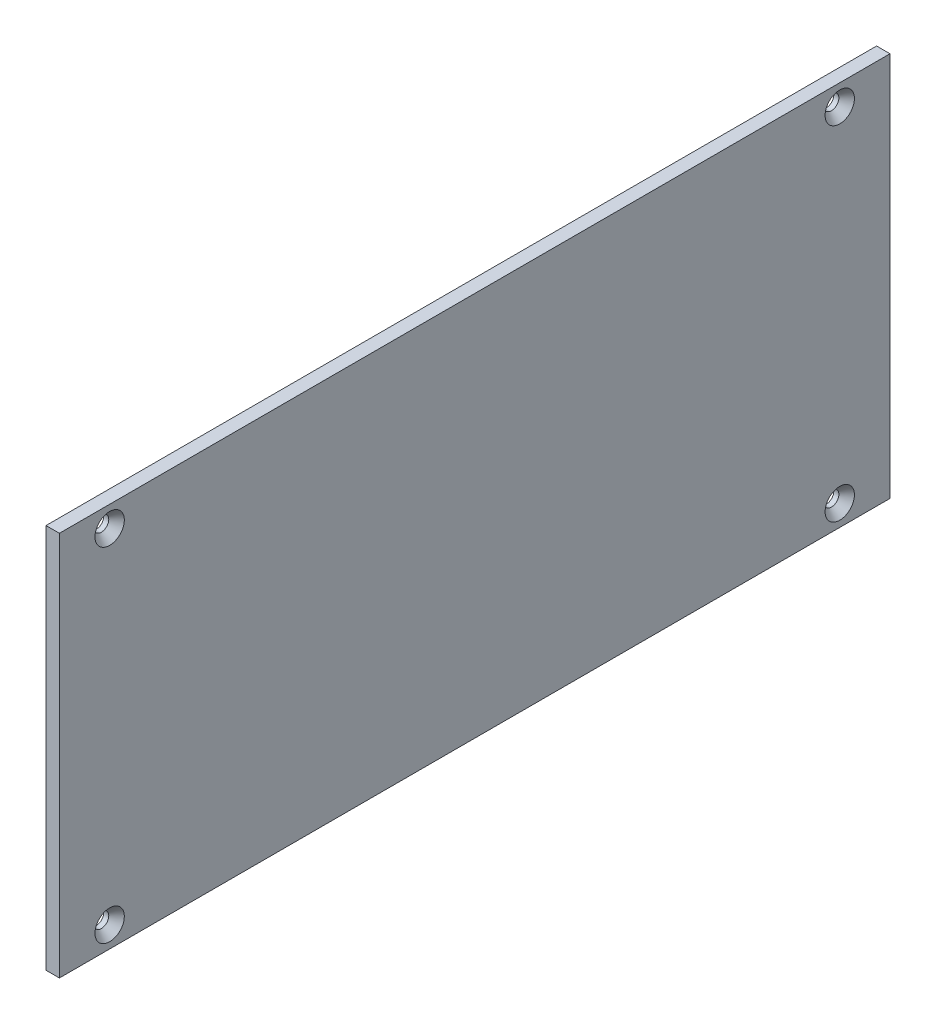
ISO-10303-21;
HEADER;
FILE_DESCRIPTION(('STEP AP214'),'2;1');
FILE_NAME('part.step','',(''),(''),'','','');
FILE_SCHEMA(('AUTOMOTIVE_DESIGN { 1 0 10303 214 1 1 1 1 }'));
ENDSEC;
DATA;
#1=APPLICATION_CONTEXT('core data for automotive mechanical design processes');
#2=APPLICATION_PROTOCOL_DEFINITION('international standard','automotive_design',2000,#1);
#3=PRODUCT_CONTEXT('',#1,'mechanical');
#4=PRODUCT('Part','Part','',(#3));
#5=PRODUCT_RELATED_PRODUCT_CATEGORY('part','',(#4));
#6=PRODUCT_DEFINITION_FORMATION('','',#4);
#7=PRODUCT_DEFINITION_CONTEXT('part definition',#1,'design');
#8=PRODUCT_DEFINITION('design','',#6,#7);
#9=PRODUCT_DEFINITION_SHAPE('','',#8);
#10=(LENGTH_UNIT() NAMED_UNIT(*) SI_UNIT(.MILLI.,.METRE.));
#11=(NAMED_UNIT(*) PLANE_ANGLE_UNIT() SI_UNIT($,.RADIAN.));
#12=(NAMED_UNIT(*) SI_UNIT($,.STERADIAN.) SOLID_ANGLE_UNIT());
#13=UNCERTAINTY_MEASURE_WITH_UNIT(LENGTH_MEASURE(1.E-05),#10,'distance_accuracy_value','');
#14=(GEOMETRIC_REPRESENTATION_CONTEXT(3) GLOBAL_UNCERTAINTY_ASSIGNED_CONTEXT((#13)) GLOBAL_UNIT_ASSIGNED_CONTEXT((#10,
#11,#12)) REPRESENTATION_CONTEXT('',''));
#15=CARTESIAN_POINT('',(0.,0.,0.));
#16=DIRECTION('',(0.,0.,1.));
#17=DIRECTION('',(1.,0.,0.));
#18=AXIS2_PLACEMENT_3D('',#15,#16,#17);
#19=CARTESIAN_POINT('',(1.6002,0.,0.));
#20=DIRECTION('',(0.,0.,-1.));
#21=DIRECTION('',(-1.,0.,0.));
#22=AXIS2_PLACEMENT_3D('',#19,#20,#21);
#23=PLANE('',#22);
#24=DIRECTION('',(0.,-1.,0.));
#25=VECTOR('',#24,1.);
#26=CARTESIAN_POINT('',(0.,0.,0.));
#27=LINE('',#26,#25);
#28=CARTESIAN_POINT('',(0.,46.,0.));
#29=VERTEX_POINT('',#28);
#30=CARTESIAN_POINT('',(0.,0.,0.));
#31=VERTEX_POINT('',#30);
#32=EDGE_CURVE('E103',#29,#31,#27,.T.);
#33=ORIENTED_EDGE('',*,*,#32,.T.);
#34=DIRECTION('',(-1.,0.,0.));
#35=VECTOR('',#34,1.);
#36=CARTESIAN_POINT('',(1.6002,0.,0.));
#37=LINE('',#36,#35);
#38=CARTESIAN_POINT('',(1.6002,0.,0.));
#39=VERTEX_POINT('',#38);
#40=EDGE_CURVE('E11',#39,#31,#37,.T.);
#41=ORIENTED_EDGE('',*,*,#40,.F.);
#42=DIRECTION('',(0.,-1.,0.));
#43=VECTOR('',#42,1.);
#44=CARTESIAN_POINT('',(1.6002,0.,0.));
#45=LINE('',#44,#43);
#46=CARTESIAN_POINT('',(1.6002,46.,0.));
#47=VERTEX_POINT('',#46);
#48=EDGE_CURVE('E91',#47,#39,#45,.T.);
#49=ORIENTED_EDGE('',*,*,#48,.F.);
#50=DIRECTION('',(-1.,0.,0.));
#51=VECTOR('',#50,1.);
#52=CARTESIAN_POINT('',(1.6002,46.,0.));
#53=LINE('',#52,#51);
#54=EDGE_CURVE('E99',#47,#29,#53,.T.);
#55=ORIENTED_EDGE('',*,*,#54,.T.);
#56=EDGE_LOOP('',(#33,#41,#49,#55));
#57=FACE_BOUND('',#56,.T.);
#58=ADVANCED_FACE('F40',(#57),#23,.F.);
#59=CARTESIAN_POINT('',(1.6002,0.,0.));
#60=DIRECTION('',(0.,1.,0.));
#61=DIRECTION('',(0.,0.,1.));
#62=AXIS2_PLACEMENT_3D('',#59,#60,#61);
#63=PLANE('',#62);
#64=DIRECTION('',(0.,0.,-1.));
#65=VECTOR('',#64,1.);
#66=CARTESIAN_POINT('',(0.,0.,0.));
#67=LINE('',#66,#65);
#68=CARTESIAN_POINT('',(0.,0.,-99.2004));
#69=VERTEX_POINT('',#68);
#70=EDGE_CURVE('E95',#31,#69,#67,.T.);
#71=ORIENTED_EDGE('',*,*,#70,.T.);
#72=DIRECTION('',(-1.,0.,0.));
#73=VECTOR('',#72,1.);
#74=CARTESIAN_POINT('',(1.6002,0.,-99.2004));
#75=LINE('',#74,#73);
#76=CARTESIAN_POINT('',(1.6002,0.,-99.2004));
#77=VERTEX_POINT('',#76);
#78=EDGE_CURVE('E48',#77,#69,#75,.T.);
#79=ORIENTED_EDGE('',*,*,#78,.F.);
#80=DIRECTION('',(0.,0.,-1.));
#81=VECTOR('',#80,1.);
#82=CARTESIAN_POINT('',(1.6002,0.,0.));
#83=LINE('',#82,#81);
#84=EDGE_CURVE('E86',#39,#77,#83,.T.);
#85=ORIENTED_EDGE('',*,*,#84,.F.);
#86=ORIENTED_EDGE('',*,*,#40,.T.);
#87=EDGE_LOOP('',(#71,#79,#85,#86));
#88=FACE_BOUND('',#87,.T.);
#89=ADVANCED_FACE('F94',(#88),#63,.F.);
#90=CARTESIAN_POINT('',(1.6002,0.,-99.2004));
#91=DIRECTION('',(0.,0.,1.));
#92=DIRECTION('',(1.,0.,0.));
#93=AXIS2_PLACEMENT_3D('',#90,#91,#92);
#94=PLANE('',#93);
#95=DIRECTION('',(0.,1.,0.));
#96=VECTOR('',#95,1.);
#97=CARTESIAN_POINT('',(0.,0.,-99.2004));
#98=LINE('',#97,#96);
#99=CARTESIAN_POINT('',(0.,46.,-99.2004));
#100=VERTEX_POINT('',#99);
#101=EDGE_CURVE('E73',#69,#100,#98,.T.);
#102=ORIENTED_EDGE('',*,*,#101,.T.);
#103=DIRECTION('',(-1.,0.,0.));
#104=VECTOR('',#103,1.);
#105=CARTESIAN_POINT('',(1.6002,46.,-99.2004));
#106=LINE('',#105,#104);
#107=CARTESIAN_POINT('',(1.6002,46.,-99.2004));
#108=VERTEX_POINT('',#107);
#109=EDGE_CURVE('E96',#108,#100,#106,.T.);
#110=ORIENTED_EDGE('',*,*,#109,.F.);
#111=DIRECTION('',(0.,1.,0.));
#112=VECTOR('',#111,1.);
#113=CARTESIAN_POINT('',(1.6002,0.,-99.2004));
#114=LINE('',#113,#112);
#115=EDGE_CURVE('E89',#77,#108,#114,.T.);
#116=ORIENTED_EDGE('',*,*,#115,.F.);
#117=ORIENTED_EDGE('',*,*,#78,.T.);
#118=EDGE_LOOP('',(#102,#110,#116,#117));
#119=FACE_BOUND('',#118,.T.);
#120=ADVANCED_FACE('F97',(#119),#94,.F.);
#121=CARTESIAN_POINT('',(1.6002,46.,0.));
#122=DIRECTION('',(0.,-1.,0.));
#123=DIRECTION('',(0.,0.,-1.));
#124=AXIS2_PLACEMENT_3D('',#121,#122,#123);
#125=PLANE('',#124);
#126=DIRECTION('',(0.,0.,1.));
#127=VECTOR('',#126,1.);
#128=CARTESIAN_POINT('',(0.,46.,0.));
#129=LINE('',#128,#127);
#130=EDGE_CURVE('E79',#100,#29,#129,.T.);
#131=ORIENTED_EDGE('',*,*,#130,.T.);
#132=ORIENTED_EDGE('',*,*,#54,.F.);
#133=DIRECTION('',(0.,0.,1.));
#134=VECTOR('',#133,1.);
#135=CARTESIAN_POINT('',(1.6002,46.,0.));
#136=LINE('',#135,#134);
#137=EDGE_CURVE('E56',#108,#47,#136,.T.);
#138=ORIENTED_EDGE('',*,*,#137,.F.);
#139=ORIENTED_EDGE('',*,*,#109,.T.);
#140=EDGE_LOOP('',(#131,#132,#138,#139));
#141=FACE_BOUND('',#140,.T.);
#142=ADVANCED_FACE('F111',(#141),#125,.F.);
#143=CARTESIAN_POINT('',(1.6002,0.,0.));
#144=DIRECTION('',(-1.,0.,0.));
#145=DIRECTION('',(0.,0.,1.));
#146=AXIS2_PLACEMENT_3D('',#143,#144,#145);
#147=PLANE('',#146);
#148=CARTESIAN_POINT('',(1.6002,43.5,-6.00000000000001));
#149=DIRECTION('',(1.,0.,0.));
#150=DIRECTION('',(0.,0.,-1.));
#151=AXIS2_PLACEMENT_3D('',#148,#149,#150);
#152=CIRCLE('',#151,1.7526);
#153=CARTESIAN_POINT('',(1.6002,43.5,-7.75260000000001));
#154=VERTEX_POINT('',#153);
#155=EDGE_CURVE('E149',#154,#154,#152,.T.);
#156=ORIENTED_EDGE('',*,*,#155,.F.);
#157=EDGE_LOOP('',(#156));
#158=FACE_BOUND('',#157,.T.);
#159=CARTESIAN_POINT('',(1.6002,2.5,-6.00000000000001));
#160=DIRECTION('',(1.,0.,0.));
#161=DIRECTION('',(0.,0.,-1.));
#162=AXIS2_PLACEMENT_3D('',#159,#160,#161);
#163=CIRCLE('',#162,1.7526);
#164=CARTESIAN_POINT('',(1.6002,2.5,-7.75260000000001));
#165=VERTEX_POINT('',#164);
#166=EDGE_CURVE('E140',#165,#165,#163,.T.);
#167=ORIENTED_EDGE('',*,*,#166,.F.);
#168=EDGE_LOOP('',(#167));
#169=FACE_BOUND('',#168,.T.);
#170=CARTESIAN_POINT('',(1.6002,2.5,-93.2004));
#171=DIRECTION('',(1.,0.,0.));
#172=DIRECTION('',(0.,0.,-1.));
#173=AXIS2_PLACEMENT_3D('',#170,#171,#172);
#174=CIRCLE('',#173,1.7526);
#175=CARTESIAN_POINT('',(1.6002,2.5,-94.953));
#176=VERTEX_POINT('',#175);
#177=EDGE_CURVE('E131',#176,#176,#174,.T.);
#178=ORIENTED_EDGE('',*,*,#177,.F.);
#179=EDGE_LOOP('',(#178));
#180=FACE_BOUND('',#179,.T.);
#181=CARTESIAN_POINT('',(1.6002,43.5,-93.2004));
#182=DIRECTION('',(1.,0.,0.));
#183=DIRECTION('',(0.,0.,-1.));
#184=AXIS2_PLACEMENT_3D('',#181,#182,#183);
#185=CIRCLE('',#184,1.7526);
#186=CARTESIAN_POINT('',(1.6002,43.5,-94.953));
#187=VERTEX_POINT('',#186);
#188=EDGE_CURVE('E122',#187,#187,#185,.T.);
#189=ORIENTED_EDGE('',*,*,#188,.F.);
#190=EDGE_LOOP('',(#189));
#191=FACE_BOUND('',#190,.T.);
#192=ORIENTED_EDGE('',*,*,#48,.T.);
#193=ORIENTED_EDGE('',*,*,#84,.T.);
#194=ORIENTED_EDGE('',*,*,#115,.T.);
#195=ORIENTED_EDGE('',*,*,#137,.T.);
#196=EDGE_LOOP('',(#192,#193,#194,#195));
#197=FACE_BOUND('',#196,.T.);
#198=ADVANCED_FACE('F87',(#158,#169,#180,#191,#197),#147,.F.);
#199=CARTESIAN_POINT('',(0.,0.,0.));
#200=DIRECTION('',(-1.,0.,0.));
#201=DIRECTION('',(0.,0.,1.));
#202=AXIS2_PLACEMENT_3D('',#199,#200,#201);
#203=PLANE('',#202);
#204=CARTESIAN_POINT('',(0.,43.5,-6.00000000000001));
#205=DIRECTION('',(1.,0.,0.));
#206=DIRECTION('',(0.,0.,-1.));
#207=AXIS2_PLACEMENT_3D('',#204,#205,#206);
#208=CIRCLE('',#207,0.889000000000001);
#209=CARTESIAN_POINT('',(0.,43.5,-6.88900000000001));
#210=VERTEX_POINT('',#209);
#211=EDGE_CURVE('E143',#210,#210,#208,.T.);
#212=ORIENTED_EDGE('',*,*,#211,.T.);
#213=EDGE_LOOP('',(#212));
#214=FACE_BOUND('',#213,.T.);
#215=CARTESIAN_POINT('',(0.,2.5,-6.00000000000001));
#216=DIRECTION('',(1.,0.,0.));
#217=DIRECTION('',(0.,0.,-1.));
#218=AXIS2_PLACEMENT_3D('',#215,#216,#217);
#219=CIRCLE('',#218,0.889);
#220=CARTESIAN_POINT('',(0.,2.5,-6.889));
#221=VERTEX_POINT('',#220);
#222=EDGE_CURVE('E134',#221,#221,#219,.T.);
#223=ORIENTED_EDGE('',*,*,#222,.T.);
#224=EDGE_LOOP('',(#223));
#225=FACE_BOUND('',#224,.T.);
#226=CARTESIAN_POINT('',(0.,2.5,-93.2004));
#227=DIRECTION('',(1.,0.,0.));
#228=DIRECTION('',(0.,0.,-1.));
#229=AXIS2_PLACEMENT_3D('',#226,#227,#228);
#230=CIRCLE('',#229,0.889);
#231=CARTESIAN_POINT('',(0.,2.5,-94.0894));
#232=VERTEX_POINT('',#231);
#233=EDGE_CURVE('E125',#232,#232,#230,.T.);
#234=ORIENTED_EDGE('',*,*,#233,.T.);
#235=EDGE_LOOP('',(#234));
#236=FACE_BOUND('',#235,.T.);
#237=CARTESIAN_POINT('',(0.,43.5,-93.2004));
#238=DIRECTION('',(1.,0.,0.));
#239=DIRECTION('',(0.,0.,-1.));
#240=AXIS2_PLACEMENT_3D('',#237,#238,#239);
#241=CIRCLE('',#240,0.889000000000001);
#242=CARTESIAN_POINT('',(0.,43.5,-94.0894));
#243=VERTEX_POINT('',#242);
#244=EDGE_CURVE('E106',#243,#243,#241,.T.);
#245=ORIENTED_EDGE('',*,*,#244,.T.);
#246=EDGE_LOOP('',(#245));
#247=FACE_BOUND('',#246,.T.);
#248=ORIENTED_EDGE('',*,*,#32,.F.);
#249=ORIENTED_EDGE('',*,*,#130,.F.);
#250=ORIENTED_EDGE('',*,*,#101,.F.);
#251=ORIENTED_EDGE('',*,*,#70,.F.);
#252=EDGE_LOOP('',(#248,#249,#250,#251));
#253=FACE_BOUND('',#252,.T.);
#254=ADVANCED_FACE('F114',(#214,#225,#236,#247,#253),#203,.T.);
#255=CARTESIAN_POINT('',(1.6002,43.5,-93.2004));
#256=DIRECTION('',(1.,0.,0.));
#257=DIRECTION('',(0.,0.,-1.));
#258=AXIS2_PLACEMENT_3D('',#255,#256,#257);
#259=CYLINDRICAL_SURFACE('',#258,0.889000000000001);
#260=ORIENTED_EDGE('',*,*,#244,.F.);
#261=EDGE_LOOP('',(#260));
#262=FACE_BOUND('',#261,.T.);
#263=CARTESIAN_POINT('',(0.606741843523937,43.5,-93.2004));
#264=DIRECTION('',(1.,0.,0.));
#265=DIRECTION('',(0.,0.,-1.));
#266=AXIS2_PLACEMENT_3D('',#263,#264,#265);
#267=CIRCLE('',#266,0.889000000000001);
#268=CARTESIAN_POINT('',(0.606741843523937,43.5,-94.0894));
#269=VERTEX_POINT('',#268);
#270=EDGE_CURVE('E119',#269,#269,#267,.T.);
#271=ORIENTED_EDGE('',*,*,#270,.T.);
#272=EDGE_LOOP('',(#271));
#273=FACE_BOUND('',#272,.T.);
#274=ADVANCED_FACE('F167',(#262,#273),#259,.F.);
#275=CARTESIAN_POINT('',(1.6002,43.5,-93.2004));
#276=DIRECTION('',(1.,0.,0.));
#277=DIRECTION('',(0.,0.,-1.));
#278=AXIS2_PLACEMENT_3D('',#275,#276,#277);
#279=CONICAL_SURFACE('',#278,1.7526,0.715584993317675);
#280=ORIENTED_EDGE('',*,*,#270,.F.);
#281=EDGE_LOOP('',(#280));
#282=FACE_BOUND('',#281,.T.);
#283=ORIENTED_EDGE('',*,*,#188,.T.);
#284=EDGE_LOOP('',(#283));
#285=FACE_BOUND('',#284,.T.);
#286=ADVANCED_FACE('F164',(#282,#285),#279,.F.);
#287=CARTESIAN_POINT('',(1.6002,2.5,-93.2004));
#288=DIRECTION('',(1.,0.,0.));
#289=DIRECTION('',(0.,0.,-1.));
#290=AXIS2_PLACEMENT_3D('',#287,#288,#289);
#291=CYLINDRICAL_SURFACE('',#290,0.889);
#292=ORIENTED_EDGE('',*,*,#233,.F.);
#293=EDGE_LOOP('',(#292));
#294=FACE_BOUND('',#293,.T.);
#295=CARTESIAN_POINT('',(0.606741843523937,2.5,-93.2004));
#296=DIRECTION('',(1.,0.,0.));
#297=DIRECTION('',(0.,0.,-1.));
#298=AXIS2_PLACEMENT_3D('',#295,#296,#297);
#299=CIRCLE('',#298,0.889);
#300=CARTESIAN_POINT('',(0.606741843523937,2.5,-94.0894));
#301=VERTEX_POINT('',#300);
#302=EDGE_CURVE('E128',#301,#301,#299,.T.);
#303=ORIENTED_EDGE('',*,*,#302,.T.);
#304=EDGE_LOOP('',(#303));
#305=FACE_BOUND('',#304,.T.);
#306=ADVANCED_FACE('F166',(#294,#305),#291,.F.);
#307=CARTESIAN_POINT('',(1.6002,2.5,-93.2004));
#308=DIRECTION('',(1.,0.,0.));
#309=DIRECTION('',(0.,0.,-1.));
#310=AXIS2_PLACEMENT_3D('',#307,#308,#309);
#311=CONICAL_SURFACE('',#310,1.7526,0.715584993317676);
#312=ORIENTED_EDGE('',*,*,#302,.F.);
#313=EDGE_LOOP('',(#312));
#314=FACE_BOUND('',#313,.T.);
#315=ORIENTED_EDGE('',*,*,#177,.T.);
#316=EDGE_LOOP('',(#315));
#317=FACE_BOUND('',#316,.T.);
#318=ADVANCED_FACE('F174',(#314,#317),#311,.F.);
#319=CARTESIAN_POINT('',(1.6002,2.5,-6.00000000000001));
#320=DIRECTION('',(1.,0.,0.));
#321=DIRECTION('',(0.,0.,-1.));
#322=AXIS2_PLACEMENT_3D('',#319,#320,#321);
#323=CYLINDRICAL_SURFACE('',#322,0.889);
#324=ORIENTED_EDGE('',*,*,#222,.F.);
#325=EDGE_LOOP('',(#324));
#326=FACE_BOUND('',#325,.T.);
#327=CARTESIAN_POINT('',(0.606741843523937,2.5,-6.00000000000001));
#328=DIRECTION('',(1.,0.,0.));
#329=DIRECTION('',(0.,0.,-1.));
#330=AXIS2_PLACEMENT_3D('',#327,#328,#329);
#331=CIRCLE('',#330,0.889);
#332=CARTESIAN_POINT('',(0.606741843523937,2.5,-6.889));
#333=VERTEX_POINT('',#332);
#334=EDGE_CURVE('E137',#333,#333,#331,.T.);
#335=ORIENTED_EDGE('',*,*,#334,.T.);
#336=EDGE_LOOP('',(#335));
#337=FACE_BOUND('',#336,.T.);
#338=ADVANCED_FACE('F208',(#326,#337),#323,.F.);
#339=CARTESIAN_POINT('',(1.6002,2.5,-6.00000000000001));
#340=DIRECTION('',(1.,0.,0.));
#341=DIRECTION('',(0.,0.,-1.));
#342=AXIS2_PLACEMENT_3D('',#339,#340,#341);
#343=CONICAL_SURFACE('',#342,1.7526,0.715584993317676);
#344=ORIENTED_EDGE('',*,*,#334,.F.);
#345=EDGE_LOOP('',(#344));
#346=FACE_BOUND('',#345,.T.);
#347=ORIENTED_EDGE('',*,*,#166,.T.);
#348=EDGE_LOOP('',(#347));
#349=FACE_BOUND('',#348,.T.);
#350=ADVANCED_FACE('F213',(#346,#349),#343,.F.);
#351=CARTESIAN_POINT('',(1.6002,43.5,-6.00000000000001));
#352=DIRECTION('',(1.,0.,0.));
#353=DIRECTION('',(0.,0.,-1.));
#354=AXIS2_PLACEMENT_3D('',#351,#352,#353);
#355=CYLINDRICAL_SURFACE('',#354,0.889000000000001);
#356=ORIENTED_EDGE('',*,*,#211,.F.);
#357=EDGE_LOOP('',(#356));
#358=FACE_BOUND('',#357,.T.);
#359=CARTESIAN_POINT('',(0.606741843523937,43.5,-6.00000000000001));
#360=DIRECTION('',(1.,0.,0.));
#361=DIRECTION('',(0.,0.,-1.));
#362=AXIS2_PLACEMENT_3D('',#359,#360,#361);
#363=CIRCLE('',#362,0.889000000000001);
#364=CARTESIAN_POINT('',(0.606741843523937,43.5,-6.88900000000001));
#365=VERTEX_POINT('',#364);
#366=EDGE_CURVE('E146',#365,#365,#363,.T.);
#367=ORIENTED_EDGE('',*,*,#366,.T.);
#368=EDGE_LOOP('',(#367));
#369=FACE_BOUND('',#368,.T.);
#370=ADVANCED_FACE('F219',(#358,#369),#355,.F.);
#371=CARTESIAN_POINT('',(1.6002,43.5,-6.00000000000001));
#372=DIRECTION('',(1.,0.,0.));
#373=DIRECTION('',(0.,0.,-1.));
#374=AXIS2_PLACEMENT_3D('',#371,#372,#373);
#375=CONICAL_SURFACE('',#374,1.7526,0.715584993317675);
#376=ORIENTED_EDGE('',*,*,#366,.F.);
#377=EDGE_LOOP('',(#376));
#378=FACE_BOUND('',#377,.T.);
#379=ORIENTED_EDGE('',*,*,#155,.T.);
#380=EDGE_LOOP('',(#379));
#381=FACE_BOUND('',#380,.T.);
#382=ADVANCED_FACE('F153',(#378,#381),#375,.F.);
#383=CLOSED_SHELL('',(#58,#89,#120,#142,#198,#254,#274,#286,#306,#318,#338,#350,#370,#382));
#384=MANIFOLD_SOLID_BREP('B2',#383);
#385=ADVANCED_BREP_SHAPE_REPRESENTATION('',(#18,#384),#14);
#386=SHAPE_DEFINITION_REPRESENTATION(#9,#385);
ENDSEC;
END-ISO-10303-21;
